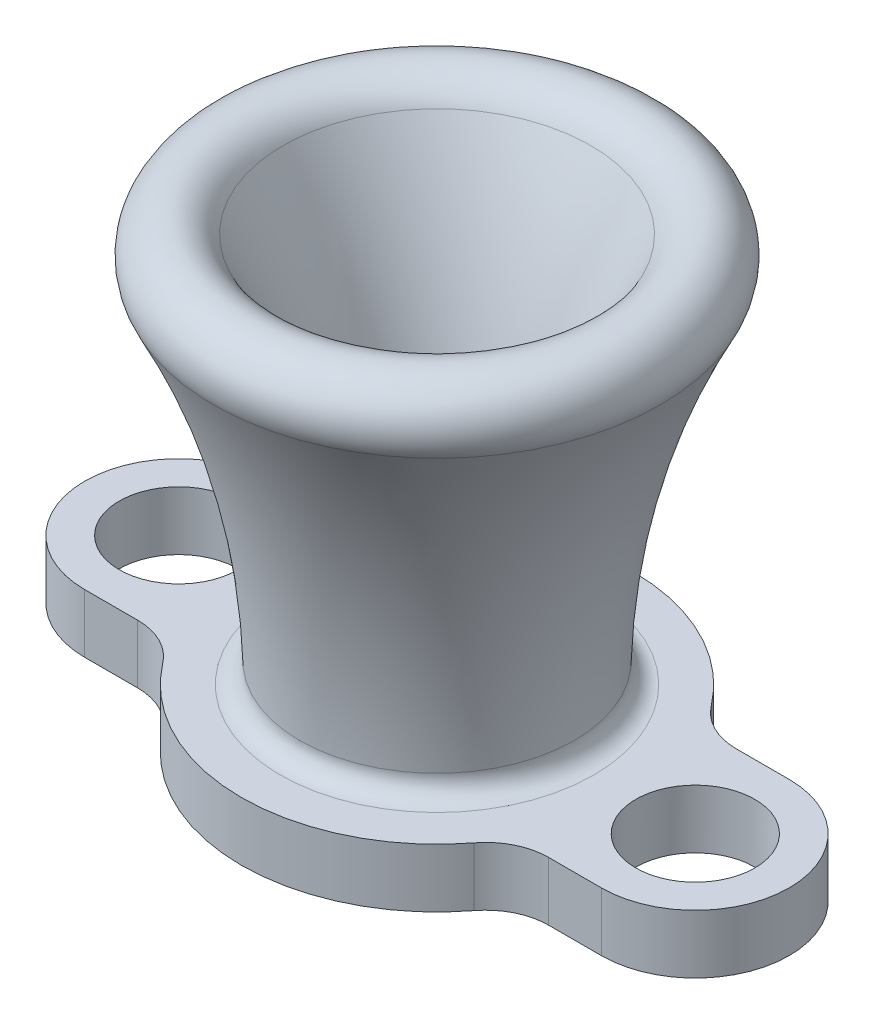
ISO-10303-21;
HEADER;
FILE_DESCRIPTION(('STEP AP214'),'2;1');
FILE_NAME('part.step','',(''),(''),'','','');
FILE_SCHEMA(('AUTOMOTIVE_DESIGN { 1 0 10303 214 1 1 1 1 }'));
ENDSEC;
DATA;
#1=APPLICATION_CONTEXT('core data for automotive mechanical design processes');
#2=APPLICATION_PROTOCOL_DEFINITION('international standard','automotive_design',2000,#1);
#3=PRODUCT_CONTEXT('',#1,'mechanical');
#4=PRODUCT('Part','Part','',(#3));
#5=PRODUCT_RELATED_PRODUCT_CATEGORY('part','',(#4));
#6=PRODUCT_DEFINITION_FORMATION('','',#4);
#7=PRODUCT_DEFINITION_CONTEXT('part definition',#1,'design');
#8=PRODUCT_DEFINITION('design','',#6,#7);
#9=PRODUCT_DEFINITION_SHAPE('','',#8);
#10=(LENGTH_UNIT() NAMED_UNIT(*) SI_UNIT(.MILLI.,.METRE.));
#11=(NAMED_UNIT(*) PLANE_ANGLE_UNIT() SI_UNIT($,.RADIAN.));
#12=(NAMED_UNIT(*) SI_UNIT($,.STERADIAN.) SOLID_ANGLE_UNIT());
#13=UNCERTAINTY_MEASURE_WITH_UNIT(LENGTH_MEASURE(1.E-05),#10,'distance_accuracy_value','');
#14=(GEOMETRIC_REPRESENTATION_CONTEXT(3) GLOBAL_UNCERTAINTY_ASSIGNED_CONTEXT((#13)) GLOBAL_UNIT_ASSIGNED_CONTEXT((#10,
#11,#12)) REPRESENTATION_CONTEXT('',''));
#15=CARTESIAN_POINT('',(0.,0.,0.));
#16=DIRECTION('',(0.,0.,1.));
#17=DIRECTION('',(1.,0.,0.));
#18=AXIS2_PLACEMENT_3D('',#15,#16,#17);
#19=CARTESIAN_POINT('',(-5.55625,0.,0.));
#20=DIRECTION('',(0.,-1.,0.));
#21=DIRECTION('',(1.,0.,0.));
#22=AXIS2_PLACEMENT_3D('',#19,#20,#21);
#23=PLANE('',#22);
#24=CARTESIAN_POINT('',(0.,0.,0.));
#25=DIRECTION('',(0.,-1.,0.));
#26=DIRECTION('',(1.,0.,0.));
#27=AXIS2_PLACEMENT_3D('',#24,#25,#26);
#28=CIRCLE('',#27,6.36037759056165);
#29=CARTESIAN_POINT('',(6.36037759056165,0.,0.));
#30=VERTEX_POINT('',#29);
#31=EDGE_CURVE('E42',#30,#30,#28,.T.);
#32=ORIENTED_EDGE('',*,*,#31,.T.);
#33=EDGE_LOOP('',(#32));
#34=FACE_BOUND('',#33,.T.);
#35=CARTESIAN_POINT('',(10.4775,0.,0.));
#36=DIRECTION('',(0.,-1.,0.));
#37=DIRECTION('',(1.,0.,0.));
#38=AXIS2_PLACEMENT_3D('',#35,#36,#37);
#39=CIRCLE('',#38,2.413);
#40=CARTESIAN_POINT('',(12.8905,0.,0.));
#41=VERTEX_POINT('',#40);
#42=EDGE_CURVE('E168',#41,#41,#39,.F.);
#43=ORIENTED_EDGE('',*,*,#42,.F.);
#44=EDGE_LOOP('',(#43));
#45=FACE_BOUND('',#44,.T.);
#46=CARTESIAN_POINT('',(-10.4775,0.,0.));
#47=DIRECTION('',(0.,-1.,0.));
#48=DIRECTION('',(1.,0.,0.));
#49=AXIS2_PLACEMENT_3D('',#46,#47,#48);
#50=CIRCLE('',#49,2.413);
#51=CARTESIAN_POINT('',(-8.0645,0.,0.));
#52=VERTEX_POINT('',#51);
#53=EDGE_CURVE('E175',#52,#52,#50,.F.);
#54=ORIENTED_EDGE('',*,*,#53,.F.);
#55=EDGE_LOOP('',(#54));
#56=FACE_BOUND('',#55,.T.);
#57=CARTESIAN_POINT('',(0.,0.,0.));
#58=DIRECTION('',(0.,-1.,0.));
#59=DIRECTION('',(1.,0.,0.));
#60=AXIS2_PLACEMENT_3D('',#57,#58,#59);
#61=CIRCLE('',#60,7.9375);
#62=CARTESIAN_POINT('',(6.31363410245321,0.,-4.81060606060607));
#63=VERTEX_POINT('',#62);
#64=CARTESIAN_POINT('',(-6.31363410245321,0.,-4.81060606060606));
#65=VERTEX_POINT('',#64);
#66=EDGE_CURVE('E169',#63,#65,#61,.F.);
#67=ORIENTED_EDGE('',*,*,#66,.T.);
#68=CARTESIAN_POINT('',(-8.33399701523824,0.,-6.35000000000001));
#69=DIRECTION('',(0.,-1.,0.));
#70=DIRECTION('',(1.,0.,0.));
#71=AXIS2_PLACEMENT_3D('',#68,#69,#70);
#72=CIRCLE('',#71,2.54);
#73=CARTESIAN_POINT('',(-8.33399701523824,0.,-3.81000000000001));
#74=VERTEX_POINT('',#73);
#75=EDGE_CURVE('E49',#65,#74,#72,.T.);
#76=ORIENTED_EDGE('',*,*,#75,.T.);
#77=DIRECTION('',(-1.,0.,0.));
#78=VECTOR('',#77,1.);
#79=CARTESIAN_POINT('',(-10.4775,0.,-3.81000000000001));
#80=LINE('',#79,#78);
#81=CARTESIAN_POINT('',(-10.4775,0.,-3.81000000000001));
#82=VERTEX_POINT('',#81);
#83=EDGE_CURVE('E162',#74,#82,#80,.T.);
#84=ORIENTED_EDGE('',*,*,#83,.T.);
#85=CARTESIAN_POINT('',(-10.4775,0.,0.));
#86=DIRECTION('',(0.,-1.,0.));
#87=DIRECTION('',(1.,0.,0.));
#88=AXIS2_PLACEMENT_3D('',#85,#86,#87);
#89=CIRCLE('',#88,3.81000000000001);
#90=CARTESIAN_POINT('',(-10.4775,0.,3.81));
#91=VERTEX_POINT('',#90);
#92=EDGE_CURVE('E164',#82,#91,#89,.F.);
#93=ORIENTED_EDGE('',*,*,#92,.T.);
#94=DIRECTION('',(1.,0.,0.));
#95=VECTOR('',#94,1.);
#96=CARTESIAN_POINT('',(-10.4775,0.,3.81));
#97=LINE('',#96,#95);
#98=CARTESIAN_POINT('',(-8.33399701523825,0.,3.81));
#99=VERTEX_POINT('',#98);
#100=EDGE_CURVE('E278',#91,#99,#97,.T.);
#101=ORIENTED_EDGE('',*,*,#100,.T.);
#102=CARTESIAN_POINT('',(-8.33399701523825,0.,6.35));
#103=DIRECTION('',(0.,-1.,0.));
#104=DIRECTION('',(1.,0.,0.));
#105=AXIS2_PLACEMENT_3D('',#102,#103,#104);
#106=CIRCLE('',#105,2.54);
#107=CARTESIAN_POINT('',(-6.31363410245322,0.,4.81060606060606));
#108=VERTEX_POINT('',#107);
#109=EDGE_CURVE('E212',#99,#108,#106,.T.);
#110=ORIENTED_EDGE('',*,*,#109,.T.);
#111=CARTESIAN_POINT('',(0.,0.,0.));
#112=DIRECTION('',(0.,-1.,0.));
#113=DIRECTION('',(1.,0.,0.));
#114=AXIS2_PLACEMENT_3D('',#111,#112,#113);
#115=CIRCLE('',#114,7.9375);
#116=CARTESIAN_POINT('',(6.31363410245321,0.,4.81060606060606));
#117=VERTEX_POINT('',#116);
#118=EDGE_CURVE('E275',#108,#117,#115,.F.);
#119=ORIENTED_EDGE('',*,*,#118,.T.);
#120=CARTESIAN_POINT('',(8.33399701523824,0.,6.35));
#121=DIRECTION('',(0.,-1.,0.));
#122=DIRECTION('',(1.,0.,0.));
#123=AXIS2_PLACEMENT_3D('',#120,#121,#122);
#124=CIRCLE('',#123,2.54);
#125=CARTESIAN_POINT('',(8.33399701523824,0.,3.81));
#126=VERTEX_POINT('',#125);
#127=EDGE_CURVE('E216',#117,#126,#124,.T.);
#128=ORIENTED_EDGE('',*,*,#127,.T.);
#129=DIRECTION('',(1.,0.,0.));
#130=VECTOR('',#129,1.);
#131=CARTESIAN_POINT('',(10.4775,0.,3.81));
#132=LINE('',#131,#130);
#133=CARTESIAN_POINT('',(10.4775,0.,3.81));
#134=VERTEX_POINT('',#133);
#135=EDGE_CURVE('E273',#126,#134,#132,.T.);
#136=ORIENTED_EDGE('',*,*,#135,.T.);
#137=CARTESIAN_POINT('',(10.4775,0.,0.));
#138=DIRECTION('',(0.,-1.,0.));
#139=DIRECTION('',(1.,0.,0.));
#140=AXIS2_PLACEMENT_3D('',#137,#138,#139);
#141=CIRCLE('',#140,3.81000000000001);
#142=CARTESIAN_POINT('',(10.4775,0.,-3.81000000000001));
#143=VERTEX_POINT('',#142);
#144=EDGE_CURVE('E269',#134,#143,#141,.F.);
#145=ORIENTED_EDGE('',*,*,#144,.T.);
#146=DIRECTION('',(-1.,0.,0.));
#147=VECTOR('',#146,1.);
#148=CARTESIAN_POINT('',(10.4775,0.,-3.81000000000001));
#149=LINE('',#148,#147);
#150=CARTESIAN_POINT('',(8.33399701523824,0.,-3.81000000000001));
#151=VERTEX_POINT('',#150);
#152=EDGE_CURVE('E153',#143,#151,#149,.T.);
#153=ORIENTED_EDGE('',*,*,#152,.T.);
#154=CARTESIAN_POINT('',(8.33399701523824,0.,-6.35000000000001));
#155=DIRECTION('',(0.,-1.,0.));
#156=DIRECTION('',(1.,0.,0.));
#157=AXIS2_PLACEMENT_3D('',#154,#155,#156);
#158=CIRCLE('',#157,2.54);
#159=EDGE_CURVE('E219',#151,#63,#158,.T.);
#160=ORIENTED_EDGE('',*,*,#159,.T.);
#161=EDGE_LOOP('',(#67,#76,#84,#93,#101,#110,#119,#128,#136,#145,#153,#160));
#162=FACE_BOUND('',#161,.T.);
#163=ADVANCED_FACE('F34',(#34,#45,#56,#162),#23,.F.);
#164=CARTESIAN_POINT('',(-14.2875,-2.38125,0.));
#165=DIRECTION('',(0.,1.,0.));
#166=DIRECTION('',(-1.,0.,0.));
#167=AXIS2_PLACEMENT_3D('',#164,#165,#166);
#168=PLANE('',#167);
#169=CARTESIAN_POINT('',(10.4775,-2.38125,0.));
#170=DIRECTION('',(0.,-1.,0.));
#171=DIRECTION('',(-1.,0.,0.));
#172=AXIS2_PLACEMENT_3D('',#169,#170,#171);
#173=CIRCLE('',#172,2.413);
#174=CARTESIAN_POINT('',(8.0645,-2.38125,0.));
#175=VERTEX_POINT('',#174);
#176=EDGE_CURVE('E165',#175,#175,#173,.T.);
#177=ORIENTED_EDGE('',*,*,#176,.F.);
#178=EDGE_LOOP('',(#177));
#179=FACE_BOUND('',#178,.T.);
#180=CARTESIAN_POINT('',(-10.4775,-2.38125,0.));
#181=DIRECTION('',(0.,-1.,0.));
#182=DIRECTION('',(1.,0.,0.));
#183=AXIS2_PLACEMENT_3D('',#180,#181,#182);
#184=CIRCLE('',#183,2.413);
#185=CARTESIAN_POINT('',(-8.0645,-2.38125,0.));
#186=VERTEX_POINT('',#185);
#187=EDGE_CURVE('E172',#186,#186,#184,.T.);
#188=ORIENTED_EDGE('',*,*,#187,.F.);
#189=EDGE_LOOP('',(#188));
#190=FACE_BOUND('',#189,.T.);
#191=CARTESIAN_POINT('',(0.,-2.38125,0.));
#192=DIRECTION('',(0.,-1.,0.));
#193=DIRECTION('',(1.,0.,0.));
#194=AXIS2_PLACEMENT_3D('',#191,#192,#193);
#195=CIRCLE('',#194,2.38125);
#196=CARTESIAN_POINT('',(2.38125,-2.38125,0.));
#197=VERTEX_POINT('',#196);
#198=EDGE_CURVE('E187',#197,#197,#195,.T.);
#199=ORIENTED_EDGE('',*,*,#198,.F.);
#200=EDGE_LOOP('',(#199));
#201=FACE_BOUND('',#200,.T.);
#202=DIRECTION('',(1.,0.,0.));
#203=VECTOR('',#202,1.);
#204=CARTESIAN_POINT('',(-10.4775,-2.38125,-3.81000000000001));
#205=LINE('',#204,#203);
#206=CARTESIAN_POINT('',(-10.4775,-2.38125,-3.81000000000001));
#207=VERTEX_POINT('',#206);
#208=CARTESIAN_POINT('',(-8.33399701523824,-2.38125,-3.81000000000001));
#209=VERTEX_POINT('',#208);
#210=EDGE_CURVE('E283',#207,#209,#205,.T.);
#211=ORIENTED_EDGE('',*,*,#210,.T.);
#212=CARTESIAN_POINT('',(-8.33399701523824,-2.38125,-6.35000000000001));
#213=DIRECTION('',(0.,1.,0.));
#214=DIRECTION('',(-1.,0.,0.));
#215=AXIS2_PLACEMENT_3D('',#212,#213,#214);
#216=CIRCLE('',#215,2.54);
#217=CARTESIAN_POINT('',(-6.31363410245321,-2.38125,-4.81060606060606));
#218=VERTEX_POINT('',#217);
#219=EDGE_CURVE('E57',#209,#218,#216,.T.);
#220=ORIENTED_EDGE('',*,*,#219,.T.);
#221=CARTESIAN_POINT('',(0.,-2.38125,0.));
#222=DIRECTION('',(0.,-1.,0.));
#223=DIRECTION('',(1.,0.,0.));
#224=AXIS2_PLACEMENT_3D('',#221,#222,#223);
#225=CIRCLE('',#224,7.9375);
#226=CARTESIAN_POINT('',(6.31363410245321,-2.38125,-4.81060606060607));
#227=VERTEX_POINT('',#226);
#228=EDGE_CURVE('E137',#218,#227,#225,.T.);
#229=ORIENTED_EDGE('',*,*,#228,.T.);
#230=CARTESIAN_POINT('',(8.33399701523824,-2.38125,-6.35000000000001));
#231=DIRECTION('',(0.,1.,0.));
#232=DIRECTION('',(-1.,0.,0.));
#233=AXIS2_PLACEMENT_3D('',#230,#231,#232);
#234=CIRCLE('',#233,2.54);
#235=CARTESIAN_POINT('',(8.33399701523824,-2.38125,-3.81000000000001));
#236=VERTEX_POINT('',#235);
#237=EDGE_CURVE('E132',#227,#236,#234,.T.);
#238=ORIENTED_EDGE('',*,*,#237,.T.);
#239=DIRECTION('',(1.,0.,0.));
#240=VECTOR('',#239,1.);
#241=CARTESIAN_POINT('',(10.4775,-2.38125,-3.81000000000001));
#242=LINE('',#241,#240);
#243=CARTESIAN_POINT('',(10.4775,-2.38125,-3.81000000000001));
#244=VERTEX_POINT('',#243);
#245=EDGE_CURVE('E125',#236,#244,#242,.T.);
#246=ORIENTED_EDGE('',*,*,#245,.T.);
#247=CARTESIAN_POINT('',(10.4775,-2.38125,0.));
#248=DIRECTION('',(0.,1.,0.));
#249=DIRECTION('',(-1.,0.,0.));
#250=AXIS2_PLACEMENT_3D('',#247,#248,#249);
#251=CIRCLE('',#250,3.81000000000001);
#252=CARTESIAN_POINT('',(10.4775,-2.38125,3.81));
#253=VERTEX_POINT('',#252);
#254=EDGE_CURVE('E130',#253,#244,#251,.T.);
#255=ORIENTED_EDGE('',*,*,#254,.F.);
#256=DIRECTION('',(-1.,0.,0.));
#257=VECTOR('',#256,1.);
#258=CARTESIAN_POINT('',(10.4775,-2.38125,3.81));
#259=LINE('',#258,#257);
#260=CARTESIAN_POINT('',(8.33399701523824,-2.38125,3.81));
#261=VERTEX_POINT('',#260);
#262=EDGE_CURVE('E136',#253,#261,#259,.T.);
#263=ORIENTED_EDGE('',*,*,#262,.T.);
#264=CARTESIAN_POINT('',(8.33399701523824,-2.38125,6.35));
#265=DIRECTION('',(0.,1.,0.));
#266=DIRECTION('',(-1.,0.,0.));
#267=AXIS2_PLACEMENT_3D('',#264,#265,#266);
#268=CIRCLE('',#267,2.54);
#269=CARTESIAN_POINT('',(6.31363410245321,-2.38125,4.81060606060606));
#270=VERTEX_POINT('',#269);
#271=EDGE_CURVE('E214',#261,#270,#268,.T.);
#272=ORIENTED_EDGE('',*,*,#271,.T.);
#273=CARTESIAN_POINT('',(0.,-2.38125,0.));
#274=DIRECTION('',(0.,-1.,0.));
#275=DIRECTION('',(-1.,0.,0.));
#276=AXIS2_PLACEMENT_3D('',#273,#274,#275);
#277=CIRCLE('',#276,7.9375);
#278=CARTESIAN_POINT('',(-6.31363410245321,-2.38125,4.81060606060606));
#279=VERTEX_POINT('',#278);
#280=EDGE_CURVE('E287',#270,#279,#277,.T.);
#281=ORIENTED_EDGE('',*,*,#280,.T.);
#282=CARTESIAN_POINT('',(-8.33399701523825,-2.38125,6.35));
#283=DIRECTION('',(0.,1.,0.));
#284=DIRECTION('',(-1.,0.,0.));
#285=AXIS2_PLACEMENT_3D('',#282,#283,#284);
#286=CIRCLE('',#285,2.54);
#287=CARTESIAN_POINT('',(-8.33399701523825,-2.38125,3.81));
#288=VERTEX_POINT('',#287);
#289=EDGE_CURVE('E210',#279,#288,#286,.T.);
#290=ORIENTED_EDGE('',*,*,#289,.T.);
#291=DIRECTION('',(-1.,0.,0.));
#292=VECTOR('',#291,1.);
#293=CARTESIAN_POINT('',(-10.4775,-2.38125,3.81));
#294=LINE('',#293,#292);
#295=CARTESIAN_POINT('',(-10.4775,-2.38125,3.81));
#296=VERTEX_POINT('',#295);
#297=EDGE_CURVE('E158',#288,#296,#294,.T.);
#298=ORIENTED_EDGE('',*,*,#297,.T.);
#299=CARTESIAN_POINT('',(-10.4775,-2.38125,0.));
#300=DIRECTION('',(0.,1.,0.));
#301=DIRECTION('',(-1.,0.,0.));
#302=AXIS2_PLACEMENT_3D('',#299,#300,#301);
#303=CIRCLE('',#302,3.81000000000001);
#304=EDGE_CURVE('E149',#207,#296,#303,.T.);
#305=ORIENTED_EDGE('',*,*,#304,.F.);
#306=EDGE_LOOP('',(#211,#220,#229,#238,#246,#255,#263,#272,#281,#290,#298,#305));
#307=FACE_BOUND('',#306,.T.);
#308=ADVANCED_FACE('F128',(#179,#190,#201,#307),#168,.F.);
#309=CARTESIAN_POINT('',(0.,0.,0.));
#310=DIRECTION('',(0.,-1.,0.));
#311=DIRECTION('',(1.,0.,0.));
#312=AXIS2_PLACEMENT_3D('',#309,#310,#311);
#313=TOROIDAL_SURFACE('',#312,36.7109375,31.1546875);
#314=CARTESIAN_POINT('',(0.,0.814501633986929,0.));
#315=DIRECTION('',(0.,-1.,0.));
#316=DIRECTION('',(1.,0.,0.));
#317=AXIS2_PLACEMENT_3D('',#314,#315,#316);
#318=CIRCLE('',#317,5.56689890011882);
#319=CARTESIAN_POINT('',(5.56689890011882,0.814501633986929,0.));
#320=VERTEX_POINT('',#319);
#321=EDGE_CURVE('E12',#320,#320,#318,.F.);
#322=ORIENTED_EDGE('',*,*,#321,.T.);
#323=EDGE_LOOP('',(#322));
#324=FACE_BOUND('',#323,.T.);
#325=CARTESIAN_POINT('',(0.,14.3500378787879,0.));
#326=DIRECTION('',(0.,-1.,0.));
#327=DIRECTION('',(1.,0.,0.));
#328=AXIS2_PLACEMENT_3D('',#325,#326,#327);
#329=CIRCLE('',#328,9.05789126454866);
#330=CARTESIAN_POINT('',(9.05789126454866,14.3500378787879,0.));
#331=VERTEX_POINT('',#330);
#332=EDGE_CURVE('E178',#331,#331,#329,.T.);
#333=ORIENTED_EDGE('',*,*,#332,.T.);
#334=EDGE_LOOP('',(#333));
#335=FACE_BOUND('',#334,.T.);
#336=ADVANCED_FACE('F240',(#324,#335),#313,.F.);
#337=CARTESIAN_POINT('',(0.,-2.38125,0.));
#338=DIRECTION('',(0.,-1.,0.));
#339=DIRECTION('',(1.,0.,0.));
#340=AXIS2_PLACEMENT_3D('',#337,#338,#339);
#341=CYLINDRICAL_SURFACE('',#340,2.38125);
#342=CARTESIAN_POINT('',(0.,0.,0.));
#343=DIRECTION('',(0.,-1.,0.));
#344=DIRECTION('',(1.,0.,0.));
#345=AXIS2_PLACEMENT_3D('',#342,#343,#344);
#346=CIRCLE('',#345,2.38125);
#347=CARTESIAN_POINT('',(2.38125,0.,0.));
#348=VERTEX_POINT('',#347);
#349=EDGE_CURVE('E184',#348,#348,#346,.T.);
#350=ORIENTED_EDGE('',*,*,#349,.F.);
#351=EDGE_LOOP('',(#350));
#352=FACE_BOUND('',#351,.T.);
#353=ORIENTED_EDGE('',*,*,#198,.T.);
#354=EDGE_LOOP('',(#353));
#355=FACE_BOUND('',#354,.T.);
#356=ADVANCED_FACE('F247',(#352,#355),#341,.F.);
#357=CARTESIAN_POINT('',(0.,0.,0.));
#358=DIRECTION('',(0.,-1.,0.));
#359=DIRECTION('',(1.,0.,0.));
#360=AXIS2_PLACEMENT_3D('',#357,#358,#359);
#361=TOROIDAL_SURFACE('',#360,36.7109375,34.3296875);
#362=CARTESIAN_POINT('',(0.,15.8124621212121,0.));
#363=DIRECTION('',(0.,-1.,0.));
#364=DIRECTION('',(1.,0.,0.));
#365=AXIS2_PLACEMENT_3D('',#362,#363,#364);
#366=CIRCLE('',#365,6.23974642526699);
#367=CARTESIAN_POINT('',(6.23974642526699,15.8124621212121,0.));
#368=VERTEX_POINT('',#367);
#369=EDGE_CURVE('E181',#368,#368,#366,.T.);
#370=ORIENTED_EDGE('',*,*,#369,.F.);
#371=EDGE_LOOP('',(#370));
#372=FACE_BOUND('',#371,.T.);
#373=ORIENTED_EDGE('',*,*,#349,.T.);
#374=EDGE_LOOP('',(#373));
#375=FACE_BOUND('',#374,.T.);
#376=ADVANCED_FACE('F344',(#372,#375),#361,.T.);
#377=CARTESIAN_POINT('',(0.,15.08125,0.));
#378=DIRECTION('',(0.,-1.,0.));
#379=DIRECTION('',(1.,0.,0.));
#380=AXIS2_PLACEMENT_3D('',#377,#378,#379);
#381=TOROIDAL_SURFACE('',#380,7.64881884490783,1.5875);
#382=ORIENTED_EDGE('',*,*,#332,.F.);
#383=EDGE_LOOP('',(#382));
#384=FACE_BOUND('',#383,.T.);
#385=ORIENTED_EDGE('',*,*,#369,.T.);
#386=EDGE_LOOP('',(#385));
#387=FACE_BOUND('',#386,.T.);
#388=ADVANCED_FACE('F340',(#384,#387),#381,.T.);
#389=CARTESIAN_POINT('',(-10.4775,40.8152640702593,0.));
#390=DIRECTION('',(0.,-1.,0.));
#391=DIRECTION('',(1.,0.,0.));
#392=AXIS2_PLACEMENT_3D('',#389,#390,#391);
#393=CYLINDRICAL_SURFACE('',#392,2.413);
#394=ORIENTED_EDGE('',*,*,#53,.T.);
#395=EDGE_LOOP('',(#394));
#396=FACE_BOUND('',#395,.T.);
#397=ORIENTED_EDGE('',*,*,#187,.T.);
#398=EDGE_LOOP('',(#397));
#399=FACE_BOUND('',#398,.T.);
#400=ADVANCED_FACE('F327',(#396,#399),#393,.F.);
#401=CARTESIAN_POINT('',(10.4775,40.8152640702593,0.));
#402=DIRECTION('',(0.,-1.,0.));
#403=DIRECTION('',(1.,0.,0.));
#404=AXIS2_PLACEMENT_3D('',#401,#402,#403);
#405=CYLINDRICAL_SURFACE('',#404,3.81000000000001);
#406=ORIENTED_EDGE('',*,*,#144,.F.);
#407=DIRECTION('',(0.,-1.,0.));
#408=VECTOR('',#407,1.);
#409=CARTESIAN_POINT('',(10.4775,40.8152640702593,3.81));
#410=LINE('',#409,#408);
#411=EDGE_CURVE('E146',#134,#253,#410,.T.);
#412=ORIENTED_EDGE('',*,*,#411,.T.);
#413=ORIENTED_EDGE('',*,*,#254,.T.);
#414=DIRECTION('',(0.,-1.,0.));
#415=VECTOR('',#414,1.);
#416=CARTESIAN_POINT('',(10.4775,40.8152640702593,-3.81000000000001));
#417=LINE('',#416,#415);
#418=EDGE_CURVE('E143',#143,#244,#417,.T.);
#419=ORIENTED_EDGE('',*,*,#418,.F.);
#420=EDGE_LOOP('',(#406,#412,#413,#419));
#421=FACE_BOUND('',#420,.T.);
#422=ADVANCED_FACE('F142',(#421),#405,.T.);
#423=CARTESIAN_POINT('',(-10.4775,40.8152640702593,0.));
#424=DIRECTION('',(0.,-1.,0.));
#425=DIRECTION('',(1.,0.,0.));
#426=AXIS2_PLACEMENT_3D('',#423,#424,#425);
#427=CYLINDRICAL_SURFACE('',#426,3.81000000000001);
#428=ORIENTED_EDGE('',*,*,#92,.F.);
#429=DIRECTION('',(0.,-1.,0.));
#430=VECTOR('',#429,1.);
#431=CARTESIAN_POINT('',(-10.4775,40.8152640702593,-3.81000000000001));
#432=LINE('',#431,#430);
#433=EDGE_CURVE('E154',#82,#207,#432,.T.);
#434=ORIENTED_EDGE('',*,*,#433,.T.);
#435=ORIENTED_EDGE('',*,*,#304,.T.);
#436=DIRECTION('',(0.,-1.,0.));
#437=VECTOR('',#436,1.);
#438=CARTESIAN_POINT('',(-10.4775,40.8152640702593,3.81));
#439=LINE('',#438,#437);
#440=EDGE_CURVE('E156',#91,#296,#439,.T.);
#441=ORIENTED_EDGE('',*,*,#440,.F.);
#442=EDGE_LOOP('',(#428,#434,#435,#441));
#443=FACE_BOUND('',#442,.T.);
#444=ADVANCED_FACE('F298',(#443),#427,.T.);
#445=CARTESIAN_POINT('',(-10.4775,40.8152640702593,-3.81000000000001));
#446=DIRECTION('',(0.,0.,-1.));
#447=DIRECTION('',(-1.,0.,0.));
#448=AXIS2_PLACEMENT_3D('',#445,#446,#447);
#449=PLANE('',#448);
#450=ORIENTED_EDGE('',*,*,#83,.F.);
#451=DIRECTION('',(0.,1.,0.));
#452=VECTOR('',#451,1.);
#453=CARTESIAN_POINT('',(-8.33399701523824,-2.38125,-3.81000000000001));
#454=LINE('',#453,#452);
#455=EDGE_CURVE('E208',#74,#209,#454,.F.);
#456=ORIENTED_EDGE('',*,*,#455,.T.);
#457=ORIENTED_EDGE('',*,*,#210,.F.);
#458=ORIENTED_EDGE('',*,*,#433,.F.);
#459=EDGE_LOOP('',(#450,#456,#457,#458));
#460=FACE_BOUND('',#459,.T.);
#461=ADVANCED_FACE('F303',(#460),#449,.T.);
#462=CARTESIAN_POINT('',(0.,40.8152640702593,0.));
#463=DIRECTION('',(0.,-1.,0.));
#464=DIRECTION('',(1.,0.,0.));
#465=AXIS2_PLACEMENT_3D('',#462,#463,#464);
#466=CYLINDRICAL_SURFACE('',#465,7.9375);
#467=ORIENTED_EDGE('',*,*,#66,.F.);
#468=DIRECTION('',(0.,-1.,0.));
#469=VECTOR('',#468,1.);
#470=CARTESIAN_POINT('',(6.3136341024532,40.8152640702593,-4.81060606060607));
#471=LINE('',#470,#469);
#472=EDGE_CURVE('E203',#63,#227,#471,.T.);
#473=ORIENTED_EDGE('',*,*,#472,.T.);
#474=ORIENTED_EDGE('',*,*,#228,.F.);
#475=DIRECTION('',(0.,-1.,0.));
#476=VECTOR('',#475,1.);
#477=CARTESIAN_POINT('',(-6.31363410245322,40.8152640702593,-4.81060606060606));
#478=LINE('',#477,#476);
#479=EDGE_CURVE('E201',#218,#65,#478,.F.);
#480=ORIENTED_EDGE('',*,*,#479,.T.);
#481=EDGE_LOOP('',(#467,#473,#474,#480));
#482=FACE_BOUND('',#481,.T.);
#483=ADVANCED_FACE('F266',(#482),#466,.T.);
#484=CARTESIAN_POINT('',(10.4775,40.8152640702593,-3.81000000000001));
#485=DIRECTION('',(0.,0.,-1.));
#486=DIRECTION('',(-1.,0.,0.));
#487=AXIS2_PLACEMENT_3D('',#484,#485,#486);
#488=PLANE('',#487);
#489=ORIENTED_EDGE('',*,*,#245,.F.);
#490=DIRECTION('',(0.,1.,0.));
#491=VECTOR('',#490,1.);
#492=CARTESIAN_POINT('',(8.33399701523824,0.,-3.81000000000001));
#493=LINE('',#492,#491);
#494=EDGE_CURVE('E206',#236,#151,#493,.T.);
#495=ORIENTED_EDGE('',*,*,#494,.T.);
#496=ORIENTED_EDGE('',*,*,#152,.F.);
#497=ORIENTED_EDGE('',*,*,#418,.T.);
#498=EDGE_LOOP('',(#489,#495,#496,#497));
#499=FACE_BOUND('',#498,.T.);
#500=ADVANCED_FACE('F151',(#499),#488,.T.);
#501=CARTESIAN_POINT('',(10.4775,40.8152640702593,3.81));
#502=DIRECTION('',(0.,0.,1.));
#503=DIRECTION('',(1.,0.,0.));
#504=AXIS2_PLACEMENT_3D('',#501,#502,#503);
#505=PLANE('',#504);
#506=ORIENTED_EDGE('',*,*,#135,.F.);
#507=DIRECTION('',(0.,1.,0.));
#508=VECTOR('',#507,1.);
#509=CARTESIAN_POINT('',(8.33399701523824,-2.38124999999999,3.81));
#510=LINE('',#509,#508);
#511=EDGE_CURVE('E198',#126,#261,#510,.F.);
#512=ORIENTED_EDGE('',*,*,#511,.T.);
#513=ORIENTED_EDGE('',*,*,#262,.F.);
#514=ORIENTED_EDGE('',*,*,#411,.F.);
#515=EDGE_LOOP('',(#506,#512,#513,#514));
#516=FACE_BOUND('',#515,.T.);
#517=ADVANCED_FACE('F315',(#516),#505,.T.);
#518=CARTESIAN_POINT('',(0.,40.8152640702593,0.));
#519=DIRECTION('',(0.,-1.,0.));
#520=DIRECTION('',(1.,0.,0.));
#521=AXIS2_PLACEMENT_3D('',#518,#519,#520);
#522=CYLINDRICAL_SURFACE('',#521,7.9375);
#523=ORIENTED_EDGE('',*,*,#118,.F.);
#524=DIRECTION('',(0.,-1.,0.));
#525=VECTOR('',#524,1.);
#526=CARTESIAN_POINT('',(-6.31363410245322,40.8152640702593,4.81060606060606));
#527=LINE('',#526,#525);
#528=EDGE_CURVE('E193',#108,#279,#527,.T.);
#529=ORIENTED_EDGE('',*,*,#528,.T.);
#530=ORIENTED_EDGE('',*,*,#280,.F.);
#531=DIRECTION('',(0.,-1.,0.));
#532=VECTOR('',#531,1.);
#533=CARTESIAN_POINT('',(6.31363410245321,40.8152640702593,4.81060606060606));
#534=LINE('',#533,#532);
#535=EDGE_CURVE('E148',#270,#117,#534,.F.);
#536=ORIENTED_EDGE('',*,*,#535,.T.);
#537=EDGE_LOOP('',(#523,#529,#530,#536));
#538=FACE_BOUND('',#537,.T.);
#539=ADVANCED_FACE('F309',(#538),#522,.T.);
#540=CARTESIAN_POINT('',(-10.4775,40.8152640702593,3.81));
#541=DIRECTION('',(0.,0.,1.));
#542=DIRECTION('',(1.,0.,0.));
#543=AXIS2_PLACEMENT_3D('',#540,#541,#542);
#544=PLANE('',#543);
#545=ORIENTED_EDGE('',*,*,#297,.F.);
#546=DIRECTION('',(0.,1.,0.));
#547=VECTOR('',#546,1.);
#548=CARTESIAN_POINT('',(-8.33399701523825,0.,3.81));
#549=LINE('',#548,#547);
#550=EDGE_CURVE('E196',#288,#99,#549,.T.);
#551=ORIENTED_EDGE('',*,*,#550,.T.);
#552=ORIENTED_EDGE('',*,*,#100,.F.);
#553=ORIENTED_EDGE('',*,*,#440,.T.);
#554=EDGE_LOOP('',(#545,#551,#552,#553));
#555=FACE_BOUND('',#554,.T.);
#556=ADVANCED_FACE('F294',(#555),#544,.T.);
#557=CARTESIAN_POINT('',(10.4775,40.8152640702593,0.));
#558=DIRECTION('',(0.,-1.,0.));
#559=DIRECTION('',(1.,0.,0.));
#560=AXIS2_PLACEMENT_3D('',#557,#558,#559);
#561=CYLINDRICAL_SURFACE('',#560,2.413);
#562=ORIENTED_EDGE('',*,*,#42,.T.);
#563=EDGE_LOOP('',(#562));
#564=FACE_BOUND('',#563,.T.);
#565=ORIENTED_EDGE('',*,*,#176,.T.);
#566=EDGE_LOOP('',(#565));
#567=FACE_BOUND('',#566,.T.);
#568=ADVANCED_FACE('F253',(#564,#567),#561,.F.);
#569=CARTESIAN_POINT('',(-8.33399701523825,40.8152640702593,6.35));
#570=DIRECTION('',(0.,-1.,0.));
#571=DIRECTION('',(1.,0.,0.));
#572=AXIS2_PLACEMENT_3D('',#569,#570,#571);
#573=CYLINDRICAL_SURFACE('',#572,2.54);
#574=ORIENTED_EDGE('',*,*,#109,.F.);
#575=ORIENTED_EDGE('',*,*,#550,.F.);
#576=ORIENTED_EDGE('',*,*,#289,.F.);
#577=ORIENTED_EDGE('',*,*,#528,.F.);
#578=EDGE_LOOP('',(#574,#575,#576,#577));
#579=FACE_BOUND('',#578,.T.);
#580=ADVANCED_FACE('F249',(#579),#573,.F.);
#581=CARTESIAN_POINT('',(8.33399701523824,40.8152640702593,6.35));
#582=DIRECTION('',(0.,-1.,0.));
#583=DIRECTION('',(1.,0.,0.));
#584=AXIS2_PLACEMENT_3D('',#581,#582,#583);
#585=CYLINDRICAL_SURFACE('',#584,2.54);
#586=ORIENTED_EDGE('',*,*,#127,.F.);
#587=ORIENTED_EDGE('',*,*,#535,.F.);
#588=ORIENTED_EDGE('',*,*,#271,.F.);
#589=ORIENTED_EDGE('',*,*,#511,.F.);
#590=EDGE_LOOP('',(#586,#587,#588,#589));
#591=FACE_BOUND('',#590,.T.);
#592=ADVANCED_FACE('F252',(#591),#585,.F.);
#593=CARTESIAN_POINT('',(8.33399701523823,40.8152640702593,-6.35000000000001));
#594=DIRECTION('',(0.,-1.,0.));
#595=DIRECTION('',(1.,0.,0.));
#596=AXIS2_PLACEMENT_3D('',#593,#594,#595);
#597=CYLINDRICAL_SURFACE('',#596,2.54);
#598=ORIENTED_EDGE('',*,*,#159,.F.);
#599=ORIENTED_EDGE('',*,*,#494,.F.);
#600=ORIENTED_EDGE('',*,*,#237,.F.);
#601=ORIENTED_EDGE('',*,*,#472,.F.);
#602=EDGE_LOOP('',(#598,#599,#600,#601));
#603=FACE_BOUND('',#602,.T.);
#604=ADVANCED_FACE('F233',(#603),#597,.F.);
#605=CARTESIAN_POINT('',(-8.33399701523825,40.8152640702593,-6.35000000000001));
#606=DIRECTION('',(0.,-1.,0.));
#607=DIRECTION('',(1.,0.,0.));
#608=AXIS2_PLACEMENT_3D('',#605,#606,#607);
#609=CYLINDRICAL_SURFACE('',#608,2.54);
#610=ORIENTED_EDGE('',*,*,#75,.F.);
#611=ORIENTED_EDGE('',*,*,#479,.F.);
#612=ORIENTED_EDGE('',*,*,#219,.F.);
#613=ORIENTED_EDGE('',*,*,#455,.F.);
#614=EDGE_LOOP('',(#610,#611,#612,#613));
#615=FACE_BOUND('',#614,.T.);
#616=ADVANCED_FACE('F228',(#615),#609,.F.);
#617=CARTESIAN_POINT('',(0.,0.793750000000001,0.));
#618=DIRECTION('',(0.,1.,0.));
#619=DIRECTION('',(-1.,0.,0.));
#620=AXIS2_PLACEMENT_3D('',#617,#618,#619);
#621=TOROIDAL_SURFACE('',#620,6.36037759056165,0.79375);
#622=ORIENTED_EDGE('',*,*,#321,.F.);
#623=EDGE_LOOP('',(#622));
#624=FACE_BOUND('',#623,.T.);
#625=ORIENTED_EDGE('',*,*,#31,.F.);
#626=EDGE_LOOP('',(#625));
#627=FACE_BOUND('',#626,.T.);
#628=ADVANCED_FACE('F36',(#624,#627),#621,.F.);
#629=CLOSED_SHELL('',(#163,#308,#336,#356,#376,#388,#400,#422,#444,#461,#483,#500,#517,#539,
#556,#568,#580,#592,#604,#616,#628));
#630=MANIFOLD_SOLID_BREP('B2',#629);
#631=ADVANCED_BREP_SHAPE_REPRESENTATION('',(#18,#630),#14);
#632=SHAPE_DEFINITION_REPRESENTATION(#9,#631);
ENDSEC;
END-ISO-10303-21;
